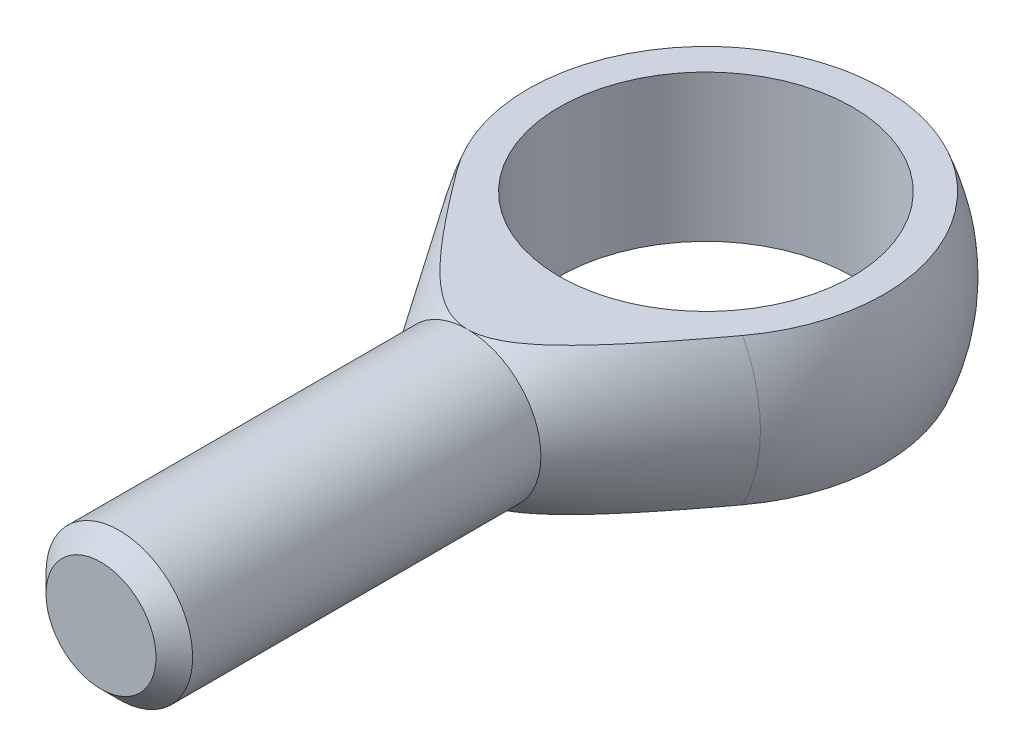
ISO-10303-21;
HEADER;
FILE_DESCRIPTION(('STEP AP214'),'2;1');
FILE_NAME('part.step','',(''),(''),'','','');
FILE_SCHEMA(('AUTOMOTIVE_DESIGN { 1 0 10303 214 1 1 1 1 }'));
ENDSEC;
DATA;
#1=APPLICATION_CONTEXT('core data for automotive mechanical design processes');
#2=APPLICATION_PROTOCOL_DEFINITION('international standard','automotive_design',2000,#1);
#3=PRODUCT_CONTEXT('',#1,'mechanical');
#4=PRODUCT('Part','Part','',(#3));
#5=PRODUCT_RELATED_PRODUCT_CATEGORY('part','',(#4));
#6=PRODUCT_DEFINITION_FORMATION('','',#4);
#7=PRODUCT_DEFINITION_CONTEXT('part definition',#1,'design');
#8=PRODUCT_DEFINITION('design','',#6,#7);
#9=PRODUCT_DEFINITION_SHAPE('','',#8);
#10=(LENGTH_UNIT() NAMED_UNIT(*) SI_UNIT(.MILLI.,.METRE.));
#11=(NAMED_UNIT(*) PLANE_ANGLE_UNIT() SI_UNIT($,.RADIAN.));
#12=(NAMED_UNIT(*) SI_UNIT($,.STERADIAN.) SOLID_ANGLE_UNIT());
#13=UNCERTAINTY_MEASURE_WITH_UNIT(LENGTH_MEASURE(1.E-05),#10,'distance_accuracy_value','');
#14=(GEOMETRIC_REPRESENTATION_CONTEXT(3) GLOBAL_UNCERTAINTY_ASSIGNED_CONTEXT((#13)) GLOBAL_UNIT_ASSIGNED_CONTEXT((#10,
#11,#12)) REPRESENTATION_CONTEXT('',''));
#15=CARTESIAN_POINT('',(0.,0.,0.));
#16=DIRECTION('',(0.,0.,1.));
#17=DIRECTION('',(1.,0.,0.));
#18=AXIS2_PLACEMENT_3D('',#15,#16,#17);
#19=CARTESIAN_POINT('',(0.,0.,26.));
#20=DIRECTION('',(0.,0.,-1.));
#21=DIRECTION('',(-1.,0.,0.));
#22=AXIS2_PLACEMENT_3D('',#19,#20,#21);
#23=CONICAL_SURFACE('',#22,8.,0.583443982313992);
#24=CARTESIAN_POINT('',(0.,0.,11.5689303158746));
#25=DIRECTION('',(0.,0.,-1.));
#26=DIRECTION('',(-1.,0.,0.));
#27=AXIS2_PLACEMENT_3D('',#24,#25,#26);
#28=CIRCLE('',#27,17.5259764734076);
#29=CARTESIAN_POINT('',(-15.5935836595197,-8.,11.5689303158746));
#30=VERTEX_POINT('',#29);
#31=CARTESIAN_POINT('',(-15.5935836595197,8.,11.5689303158746));
#32=VERTEX_POINT('',#31);
#33=EDGE_CURVE('E97',#30,#32,#28,.T.);
#34=ORIENTED_EDGE('',*,*,#33,.F.);
#35=CARTESIAN_POINT('',(-41.7893397113062,-8.,-26.337669903796));
#36=CARTESIAN_POINT('',(-41.1557149048194,-8.,-25.394905966181));
#37=CARTESIAN_POINT('',(-40.5217446952214,-8.,-24.4523741212144));
#38=CARTESIAN_POINT('',(-39.2529967304389,-8.,-22.5678533742964));
#39=CARTESIAN_POINT('',(-38.618218974807,-8.,-21.6258644726461));
#40=CARTESIAN_POINT('',(-36.71236789742,-8.,-18.8006355634881));
#41=CARTESIAN_POINT('',(-35.4399088161728,-8.,-16.9183299344262));
#42=CARTESIAN_POINT('',(-32.8858967777199,-8.,-13.1510921420859));
#43=CARTESIAN_POINT('',(-31.6043277485039,-8.,-11.2661708644965));
#44=CARTESIAN_POINT('',(-29.6766484690636,-8.,-8.44255526329719));
#45=CARTESIAN_POINT('',(-29.033231689383,-8.,-7.50202224300151));
#46=CARTESIAN_POINT('',(-27.7442089664126,-8.,-5.62245895299214));
#47=CARTESIAN_POINT('',(-27.0986030262145,-8.,-4.68342868115889));
#48=CARTESIAN_POINT('',(-25.7984650944112,-8.,-2.7981615987806));
#49=CARTESIAN_POINT('',(-25.1439070952088,-8.,-1.85194271580022));
#50=CARTESIAN_POINT('',(-23.8313788922483,-8.,0.0381249766633964));
#51=CARTESIAN_POINT('',(-23.1734086929347,-8.,0.981973789231412));
#52=CARTESIAN_POINT('',(-21.8529337576566,-8.,2.86691961563203));
#53=CARTESIAN_POINT('',(-21.1904277190853,-8.,3.80801571780575));
#54=CARTESIAN_POINT('',(-19.8597915373833,-8.,5.68619961889504));
#55=CARTESIAN_POINT('',(-19.1916615021039,-8.,6.62328749415891));
#56=CARTESIAN_POINT('',(-17.8490377414385,-8.,8.49051631845942));
#57=CARTESIAN_POINT('',(-17.1745566185374,-8.,9.42066630484811));
#58=CARTESIAN_POINT('',(-16.1550745456963,-8.,10.8102608695757));
#59=CARTESIAN_POINT('',(-15.8139386012655,-8.,11.2725408824194));
#60=CARTESIAN_POINT('',(-15.1285799337566,-8.,12.1948069144964));
#61=CARTESIAN_POINT('',(-14.7843572214204,-8.,12.6547929417041));
#62=CARTESIAN_POINT('',(-14.0923747580127,-8.,13.5717418107129));
#63=CARTESIAN_POINT('',(-13.7446168443339,-8.,14.0287060377496));
#64=CARTESIAN_POINT('',(-13.0445907078003,-8.,14.9391654201993));
#65=CARTESIAN_POINT('',(-12.6923225285202,-8.,15.3926606090601));
#66=CARTESIAN_POINT('',(-11.9822609691241,-8.,16.2952051774635));
#67=CARTESIAN_POINT('',(-11.6244683870814,-8.,16.7442551840711));
#68=CARTESIAN_POINT('',(-10.9019009711095,-8.,17.6366931011255));
#69=CARTESIAN_POINT('',(-10.5371264612838,-8.,18.0800812728114));
#70=CARTESIAN_POINT('',(-10.0453269965719,-8.,18.6655983345714));
#71=CARTESIAN_POINT('',(-9.92228865482356,-8.,18.8110804538051));
#72=CARTESIAN_POINT('',(-9.67512545946615,-8.,19.1011245077806));
#73=CARTESIAN_POINT('',(-9.55100058449968,-8.,19.2456864243375));
#74=CARTESIAN_POINT('',(-9.30156002344154,-8.,19.5337955344612));
#75=CARTESIAN_POINT('',(-9.17624426489803,-8.,19.677342665351));
#76=CARTESIAN_POINT('',(-8.92431499672733,-8.,19.9632920604024));
#77=CARTESIAN_POINT('',(-8.79770149101735,-8.,20.1056943280174));
#78=CARTESIAN_POINT('',(-8.41504916012535,-8.,20.5317407790535));
#79=CARTESIAN_POINT('',(-8.15685724743617,-8.,20.8134608639338));
#80=CARTESIAN_POINT('',(-7.63352118646919,-8.,21.3703563931461));
#81=CARTESIAN_POINT('',(-7.36837750568537,-8.,21.6455322752029));
#82=CARTESIAN_POINT('',(-6.82265047469856,-8.,22.194262460371));
#83=CARTESIAN_POINT('',(-6.54184597688306,-8.,22.4675977243717));
#84=CARTESIAN_POINT('',(-5.96877991117981,-8.,23.0023740909599));
#85=CARTESIAN_POINT('',(-5.6765136245208,-8.,23.2638101969509));
#86=CARTESIAN_POINT('',(-5.22779910687375,-8.,23.6429870211736));
#87=CARTESIAN_POINT('',(-5.07670513469256,-8.,23.7670682966121));
#88=CARTESIAN_POINT('',(-4.77052383447761,-8.,24.0101890400232));
#89=CARTESIAN_POINT('',(-4.61543695116889,-8.,24.1292290656108));
#90=CARTESIAN_POINT('',(-4.30091121552167,-8.,24.3611709536904));
#91=CARTESIAN_POINT('',(-4.14147589954388,-8.,24.4740775929998));
#92=CARTESIAN_POINT('',(-3.81767218441554,-8.,24.6925543289047));
#93=CARTESIAN_POINT('',(-3.65330476387961,-8.,24.7981258673071));
#94=CARTESIAN_POINT('',(-3.33134243037947,-8.,24.9929764293246));
#95=CARTESIAN_POINT('',(-3.17412865893547,-8.,25.0828821963727));
#96=CARTESIAN_POINT('',(-2.85474077312491,-8.,25.253487389059));
#97=CARTESIAN_POINT('',(-2.69256651220986,-8.,25.3341865423711));
#98=CARTESIAN_POINT('',(-2.36335395977583,-8.,25.4844516330758));
#99=CARTESIAN_POINT('',(-2.19632224838547,-8.,25.5540318717474));
#100=CARTESIAN_POINT('',(-1.85740960386001,-8.,25.680121662853));
#101=CARTESIAN_POINT('',(-1.68553055556196,-8.,25.7366362192176));
#102=CARTESIAN_POINT('',(-1.36237703270374,-8.,25.8275233153272));
#103=CARTESIAN_POINT('',(-1.21167023381903,-8.,25.8639063663816));
#104=CARTESIAN_POINT('',(-0.9077943549243,-8.,25.9243557327484));
#105=CARTESIAN_POINT('',(-0.754625537518869,-8.,25.948423352779));
#106=CARTESIAN_POINT('',(-0.446871147442258,-8.,25.9833312715307));
#107=CARTESIAN_POINT('',(-0.2922865340359,-8.,25.9941799423972));
#108=CARTESIAN_POINT('',(0.017243593059444,-8.,26.0022390275379));
#109=CARTESIAN_POINT('',(0.172189110252937,-8.,25.9994493088218));
#110=CARTESIAN_POINT('',(0.481119496647998,-8.,25.9803533180131));
#111=CARTESIAN_POINT('',(0.635104996521218,-8.,25.9640571356025));
#112=CARTESIAN_POINT('',(0.941147894900533,-8.,25.9186042646396));
#113=CARTESIAN_POINT('',(1.09320525868139,-8.,25.8894473448063));
#114=CARTESIAN_POINT('',(1.39462211112206,-8.,25.8192945419706));
#115=CARTESIAN_POINT('',(1.54398017684953,-8.,25.778292597782));
#116=CARTESIAN_POINT('',(1.83936434374538,-8.,25.6857181652654));
#117=CARTESIAN_POINT('',(1.98539004514737,-8.,25.6341444160245));
#118=CARTESIAN_POINT('',(2.37334785538949,-8.,25.482957652231));
#119=CARTESIAN_POINT('',(2.61194225836789,-8.,25.3747496800453));
#120=CARTESIAN_POINT('',(3.07871304264103,-8.,25.1378138107562));
#121=CARTESIAN_POINT('',(3.30688082819653,-8.,25.0090693623793));
#122=CARTESIAN_POINT('',(3.75460909156237,-8.,24.7352391664537));
#123=CARTESIAN_POINT('',(3.97412329515662,-8.,24.590078363952));
#124=CARTESIAN_POINT('',(4.29685928466906,-8.,24.3632590449313));
#125=CARTESIAN_POINT('',(4.40333297776572,-8.,24.2861520457739));
#126=CARTESIAN_POINT('',(4.61428006071462,-8.,24.1292481111753));
#127=CARTESIAN_POINT('',(4.71875347899604,-8.,24.0494512140091));
#128=CARTESIAN_POINT('',(5.01599602551024,-8.,23.8169891709865));
#129=CARTESIAN_POINT('',(5.20645303336845,-8.,23.661364649537));
#130=CARTESIAN_POINT('',(5.58177782763677,-8.,23.3434920456619));
#131=CARTESIAN_POINT('',(5.76664460877452,-8.,23.1812427841153));
#132=CARTESIAN_POINT('',(6.13163792982774,-8.,22.8512912982533));
#133=CARTESIAN_POINT('',(6.31176150305143,-8.,22.6835858012784));
#134=CARTESIAN_POINT('',(6.6678153780134,-8.,22.3437701591296));
#135=CARTESIAN_POINT('',(6.84374539269315,-8.,22.1716597140898));
#136=CARTESIAN_POINT('',(7.19239026527735,-8.,21.823357240046));
#137=CARTESIAN_POINT('',(7.36509598402218,-8.,21.6471560814312));
#138=CARTESIAN_POINT('',(7.70730993896773,-8.,21.2916715681948));
#139=CARTESIAN_POINT('',(7.87681806983155,-8.,21.1123881124048));
#140=CARTESIAN_POINT('',(8.38103102730631,-8.,20.570779100684));
#141=CARTESIAN_POINT('',(8.71155686515788,-8.,20.2045611594055));
#142=CARTESIAN_POINT('',(9.36696230830657,-8.,19.4610833670985));
#143=CARTESIAN_POINT('',(9.69176086119772,-8.,19.083752516552));
#144=CARTESIAN_POINT('',(10.3343867706041,-8.,18.3231671296867));
#145=CARTESIAN_POINT('',(10.6522136230684,-8.,17.9399121684498));
#146=CARTESIAN_POINT('',(11.2817141552758,-8.,17.1694624759606));
#147=CARTESIAN_POINT('',(11.5933972568266,-8.,16.7822754262249));
#148=CARTESIAN_POINT('',(12.0574777532771,-8.,16.1987731967306));
#149=CARTESIAN_POINT('',(12.2115949032139,-8.,16.0038218367269));
#150=CARTESIAN_POINT('',(12.5187851806359,-8.,15.6130984378208));
#151=CARTESIAN_POINT('',(12.6718583089522,-8.,15.4173263995719));
#152=CARTESIAN_POINT('',(13.1608086446923,-8.,14.7888649640009));
#153=CARTESIAN_POINT('',(13.4948591455196,-8.,14.3547536082084));
#154=CARTESIAN_POINT('',(14.1591833346824,-8.,13.4836481710026));
#155=CARTESIAN_POINT('',(14.4894569800663,-8.,13.0466540568947));
#156=CARTESIAN_POINT('',(15.1468695054673,-8.,12.1702894039626));
#157=CARTESIAN_POINT('',(15.4740082642428,-8.,11.7309187742466));
#158=CARTESIAN_POINT('',(16.1256342829024,-8.,10.8502147177181));
#159=CARTESIAN_POINT('',(16.4501215318242,-8.,10.4088812828022));
#160=CARTESIAN_POINT('',(17.4203159238502,-8.,9.08229630095648));
#161=CARTESIAN_POINT('',(18.0626615174788,-8.,8.19458617130412));
#162=CARTESIAN_POINT('',(19.3407385593065,-8.,6.41441777093976));
#163=CARTESIAN_POINT('',(19.9764699547765,-8.,5.52195946246024));
#164=CARTESIAN_POINT('',(21.2436892097622,-8.,3.73232190124357));
#165=CARTESIAN_POINT('',(21.8751705950962,-8.,2.83513806753905));
#166=CARTESIAN_POINT('',(23.1341862593397,-8.,1.03800127547844));
#167=CARTESIAN_POINT('',(23.7617205196844,-8.,0.138048304127656));
#168=CARTESIAN_POINT('',(25.0135896024525,-8.,-1.66395391791588));
#169=CARTESIAN_POINT('',(25.6379247194812,-8.,-2.56600296404517));
#170=CARTESIAN_POINT('',(26.884052891512,-8.,-4.37185503861865));
#171=CARTESIAN_POINT('',(27.505845945233,-8.,-5.27565806794637));
#172=CARTESIAN_POINT('',(29.2759214171934,-8.,-7.85485794708336));
#173=CARTESIAN_POINT('',(30.4216893880862,-8.,-9.53198026409849));
#174=CARTESIAN_POINT('',(32.7082005475804,-8.,-12.8897134135342));
#175=CARTESIAN_POINT('',(33.8489435911886,-8.,-14.5703243445859));
#176=CARTESIAN_POINT('',(36.1245857153204,-8.,-17.9310043169582));
#177=CARTESIAN_POINT('',(37.2594916763625,-8.,-19.6110687004831));
#178=CARTESIAN_POINT('',(38.9596924002792,-8.,-22.1325794836291));
#179=CARTESIAN_POINT('',(39.5260569796141,-8.,-22.9733049475566));
#180=CARTESIAN_POINT('',(40.6581530556589,-8.,-24.6551816601679));
#181=CARTESIAN_POINT('',(41.223884552559,-8.,-25.4963329087237));
#182=CARTESIAN_POINT('',(41.7893397113062,-8.,-26.3376699037959));
#183=B_SPLINE_CURVE_WITH_KNOTS('',3,(#35,#36,#37,#38,#39,#40,#41,#42,#43,#44,#45,#46,#47,#48,
#49,#50,#51,#52,#53,#54,#55,#56,#57,#58,#59,#60,#61,#62,#63,#64,#65,#66,#67,#68,#69,#70,#71,#72,
#73,#74,#75,#76,#77,#78,#79,#80,#81,#82,#83,#84,#85,#86,#87,#88,#89,#90,#91,#92,#93,#94,#95,#96,
#97,#98,#99,#100,#101,#102,#103,#104,#105,#106,#107,#108,#109,#110,#111,#112,#113,#114,#115,
#116,#117,#118,#119,#120,#121,#122,#123,#124,#125,#126,#127,#128,#129,#130,#131,#132,#133,#134,
#135,#136,#137,#138,#139,#140,#141,#142,#143,#144,#145,#146,#147,#148,#149,#150,#151,#152,#153,
#154,#155,#156,#157,#158,#159,#160,#161,#162,#163,#164,#165,#166,#167,#168,#169,#170,#171,#172,
#173,#174,#175,#176,#177,#178,#179,#180,#181,#182),.UNSPECIFIED.,.F.,.F.,(4,2,2,2,2,2,2,2,2,2,2,
2,2,2,2,2,2,2,2,2,2,2,2,2,2,2,2,2,2,2,2,2,2,2,2,2,2,2,2,2,2,2,2,2,2,2,2,2,2,2,2,2,2,2,2,2,2,2,2,
2,2,2,2,2,2,2,2,2,2,2,2,2,2,4),(0.,3.40772031445457,6.81544251742736,13.6315973726992,
20.469575344042,23.8882404822343,27.3069007942674,30.7585592613717,34.2102132336201,
37.6629039219994,41.1155285483487,44.5623424381296,46.2859011427508,48.0094538517592,
49.7321524175262,51.4548343524362,53.1772697092747,54.8996253030469,55.4712253702205,
56.042836698383,56.6144830281691,57.1861276329635,58.3324420856408,59.4786796474449,
60.6540550389304,61.8299195148678,62.4163767003356,63.002768847175,63.5886975509105,
64.1745107551842,64.7175725017291,65.2606503075559,65.8030238781542,66.345189383677,
66.8098370899034,67.2744355603417,67.7387396268031,68.2030482207791,68.6670102763717,
69.1309806759682,69.5951889144585,70.0594525519157,70.844015410507,71.6292138085734,
72.4181594872099,72.8125119792112,73.2068588622576,73.944512882573,74.6822987733587,
75.4205356577836,76.1588229319035,76.8989562316257,77.6391138708417,79.1188647471267,
80.6123716930422,82.105986265329,83.5970969940853,84.3426296310782,85.0881616745519,
86.7314168572388,88.3746907089671,90.0180278598085,91.6613718014572,94.9485318377912,
98.2357180597637,101.527112369136,104.8185221476,108.10962317107,111.400725852797,
117.494126364826,123.587701563831,129.670102454631,132.711202920313,135.75230247217),.UNSPECIFIED.);
#184=CARTESIAN_POINT('',(0.,-8.00000000000001,26.));
#185=VERTEX_POINT('',#184);
#186=EDGE_CURVE('E93',#30,#185,#183,.T.);
#187=ORIENTED_EDGE('',*,*,#186,.T.);
#188=CARTESIAN_POINT('',(0.,0.,26.));
#189=DIRECTION('',(0.,0.,-1.));
#190=DIRECTION('',(-1.,0.,0.));
#191=AXIS2_PLACEMENT_3D('',#188,#189,#190);
#192=CIRCLE('',#191,8.);
#193=CARTESIAN_POINT('',(0.,8.00000000000001,26.));
#194=VERTEX_POINT('',#193);
#195=EDGE_CURVE('E92',#185,#194,#192,.T.);
#196=ORIENTED_EDGE('',*,*,#195,.T.);
#197=CARTESIAN_POINT('',(41.7893397113062,8.,-26.3376699037959));
#198=CARTESIAN_POINT('',(41.1557149048194,8.,-25.394905966181));
#199=CARTESIAN_POINT('',(40.5217446952214,8.,-24.4523741212144));
#200=CARTESIAN_POINT('',(39.2529967304389,8.,-22.5678533742964));
#201=CARTESIAN_POINT('',(38.618218974807,8.,-21.6258644726461));
#202=CARTESIAN_POINT('',(36.71236789742,8.,-18.8006355634881));
#203=CARTESIAN_POINT('',(35.4399088161728,8.,-16.9183299344262));
#204=CARTESIAN_POINT('',(32.88589677772,8.,-13.1510921420859));
#205=CARTESIAN_POINT('',(31.6043277485039,8.,-11.2661708644966));
#206=CARTESIAN_POINT('',(29.6766484690636,8.,-8.44255526329724));
#207=CARTESIAN_POINT('',(29.0332316893831,8.,-7.50202224300156));
#208=CARTESIAN_POINT('',(27.7442089664127,8.,-5.6224589529922));
#209=CARTESIAN_POINT('',(27.0986030262145,8.,-4.68342868115895));
#210=CARTESIAN_POINT('',(25.7984650944112,8.,-2.79816159878066));
#211=CARTESIAN_POINT('',(25.1439070952088,8.,-1.85194271580028));
#212=CARTESIAN_POINT('',(23.8313788922483,8.,0.0381249766633464));
#213=CARTESIAN_POINT('',(23.1734086929347,8.,0.981973789231365));
#214=CARTESIAN_POINT('',(21.8529337576566,8.,2.86691961563199));
#215=CARTESIAN_POINT('',(21.1904277190853,8.,3.80801571780572));
#216=CARTESIAN_POINT('',(19.8597915373833,8.,5.686199618895));
#217=CARTESIAN_POINT('',(19.1916615021039,8.,6.62328749415887));
#218=CARTESIAN_POINT('',(17.8490377414385,8.,8.49051631845939));
#219=CARTESIAN_POINT('',(17.1745566185374,8.,9.42066630484808));
#220=CARTESIAN_POINT('',(16.1550745456963,8.,10.8102608695756));
#221=CARTESIAN_POINT('',(15.8139386012655,8.,11.2725408824194));
#222=CARTESIAN_POINT('',(15.1285799337566,8.,12.1948069144964));
#223=CARTESIAN_POINT('',(14.7843572214204,8.,12.6547929417041));
#224=CARTESIAN_POINT('',(14.0923747580127,8.,13.5717418107129));
#225=CARTESIAN_POINT('',(13.7446168443339,8.,14.0287060377496));
#226=CARTESIAN_POINT('',(13.0445907078003,8.,14.9391654201993));
#227=CARTESIAN_POINT('',(12.6923225285202,8.,15.3926606090601));
#228=CARTESIAN_POINT('',(11.9822609691241,8.,16.2952051774635));
#229=CARTESIAN_POINT('',(11.6244683870814,8.,16.7442551840711));
#230=CARTESIAN_POINT('',(10.9019009711095,8.,17.6366931011255));
#231=CARTESIAN_POINT('',(10.5371264612838,8.,18.0800812728114));
#232=CARTESIAN_POINT('',(10.0453269965719,8.,18.6655983345714));
#233=CARTESIAN_POINT('',(9.92228865482356,8.,18.8110804538051));
#234=CARTESIAN_POINT('',(9.67512545946615,8.,19.1011245077806));
#235=CARTESIAN_POINT('',(9.55100058449968,8.,19.2456864243375));
#236=CARTESIAN_POINT('',(9.30156002344154,8.,19.5337955344612));
#237=CARTESIAN_POINT('',(9.17624426489803,8.,19.677342665351));
#238=CARTESIAN_POINT('',(8.92431499672733,8.,19.9632920604024));
#239=CARTESIAN_POINT('',(8.79770149101735,8.,20.1056943280174));
#240=CARTESIAN_POINT('',(8.41504916012535,8.,20.5317407790535));
#241=CARTESIAN_POINT('',(8.15685724743617,8.,20.8134608639338));
#242=CARTESIAN_POINT('',(7.63352118646919,8.,21.3703563931461));
#243=CARTESIAN_POINT('',(7.36837750568537,8.,21.6455322752029));
#244=CARTESIAN_POINT('',(6.82265047469856,8.,22.194262460371));
#245=CARTESIAN_POINT('',(6.54184597688306,8.,22.4675977243717));
#246=CARTESIAN_POINT('',(5.96877991117981,8.,23.0023740909599));
#247=CARTESIAN_POINT('',(5.6765136245208,8.,23.2638101969509));
#248=CARTESIAN_POINT('',(5.22779910687375,8.,23.6429870211736));
#249=CARTESIAN_POINT('',(5.07670513469256,8.,23.7670682966121));
#250=CARTESIAN_POINT('',(4.77052383447761,8.,24.0101890400232));
#251=CARTESIAN_POINT('',(4.61543695116889,8.,24.1292290656108));
#252=CARTESIAN_POINT('',(4.30091121552167,8.,24.3611709536904));
#253=CARTESIAN_POINT('',(4.14147589954387,8.,24.4740775929999));
#254=CARTESIAN_POINT('',(3.81767218441553,8.,24.6925543289047));
#255=CARTESIAN_POINT('',(3.65330476387961,8.,24.7981258673071));
#256=CARTESIAN_POINT('',(3.33134243037946,8.,24.9929764293246));
#257=CARTESIAN_POINT('',(3.17412865893546,8.,25.0828821963727));
#258=CARTESIAN_POINT('',(2.85474077312491,8.,25.253487389059));
#259=CARTESIAN_POINT('',(2.69256651220985,8.,25.3341865423711));
#260=CARTESIAN_POINT('',(2.36335395977583,8.,25.4844516330758));
#261=CARTESIAN_POINT('',(2.19632224838547,8.,25.5540318717474));
#262=CARTESIAN_POINT('',(1.85740960386001,8.,25.680121662853));
#263=CARTESIAN_POINT('',(1.68553055556195,8.,25.7366362192176));
#264=CARTESIAN_POINT('',(1.36237703270374,8.,25.8275233153272));
#265=CARTESIAN_POINT('',(1.21167023381903,8.,25.8639063663816));
#266=CARTESIAN_POINT('',(0.907794354924299,8.,25.9243557327484));
#267=CARTESIAN_POINT('',(0.754625537518868,8.,25.948423352779));
#268=CARTESIAN_POINT('',(0.446871147442256,8.,25.9833312715307));
#269=CARTESIAN_POINT('',(0.292286534035899,8.,25.9941799423972));
#270=CARTESIAN_POINT('',(-0.0172435930594455,8.,26.0022390275379));
#271=CARTESIAN_POINT('',(-0.172189110252938,8.,25.9994493088218));
#272=CARTESIAN_POINT('',(-0.481119496648,8.,25.9803533180131));
#273=CARTESIAN_POINT('',(-0.63510499652122,8.,25.9640571356025));
#274=CARTESIAN_POINT('',(-0.941147894900534,8.,25.9186042646396));
#275=CARTESIAN_POINT('',(-1.09320525868139,8.,25.8894473448063));
#276=CARTESIAN_POINT('',(-1.39462211112206,8.,25.8192945419706));
#277=CARTESIAN_POINT('',(-1.54398017684953,8.,25.778292597782));
#278=CARTESIAN_POINT('',(-1.83936434374538,8.,25.6857181652654));
#279=CARTESIAN_POINT('',(-1.98539004514737,8.,25.6341444160245));
#280=CARTESIAN_POINT('',(-2.37334785538949,8.,25.482957652231));
#281=CARTESIAN_POINT('',(-2.6119422583679,8.,25.3747496800453));
#282=CARTESIAN_POINT('',(-3.07871304264103,8.,25.1378138107562));
#283=CARTESIAN_POINT('',(-3.30688082819653,8.,25.0090693623793));
#284=CARTESIAN_POINT('',(-3.75460909156237,8.,24.7352391664537));
#285=CARTESIAN_POINT('',(-3.97412329515662,8.,24.590078363952));
#286=CARTESIAN_POINT('',(-4.29685928466906,8.,24.3632590449313));
#287=CARTESIAN_POINT('',(-4.40333297776573,8.,24.2861520457739));
#288=CARTESIAN_POINT('',(-4.61428006071463,8.,24.1292481111753));
#289=CARTESIAN_POINT('',(-4.71875347899605,8.,24.0494512140091));
#290=CARTESIAN_POINT('',(-5.01599602551024,8.,23.8169891709865));
#291=CARTESIAN_POINT('',(-5.20645303336846,8.,23.661364649537));
#292=CARTESIAN_POINT('',(-5.58177782763677,8.,23.3434920456619));
#293=CARTESIAN_POINT('',(-5.76664460877452,8.,23.1812427841153));
#294=CARTESIAN_POINT('',(-6.13163792982773,8.,22.8512912982533));
#295=CARTESIAN_POINT('',(-6.31176150305142,8.,22.6835858012784));
#296=CARTESIAN_POINT('',(-6.6678153780134,8.,22.3437701591296));
#297=CARTESIAN_POINT('',(-6.84374539269315,8.,22.1716597140898));
#298=CARTESIAN_POINT('',(-7.19239026527734,8.,21.823357240046));
#299=CARTESIAN_POINT('',(-7.36509598402218,8.,21.6471560814312));
#300=CARTESIAN_POINT('',(-7.70730993896774,8.,21.2916715681947));
#301=CARTESIAN_POINT('',(-7.87681806983155,8.,21.1123881124048));
#302=CARTESIAN_POINT('',(-8.38103102730632,8.,20.5707791006839));
#303=CARTESIAN_POINT('',(-8.71155686515789,8.,20.2045611594055));
#304=CARTESIAN_POINT('',(-9.36696230830658,8.,19.4610833670985));
#305=CARTESIAN_POINT('',(-9.69176086119773,8.,19.0837525165519));
#306=CARTESIAN_POINT('',(-10.3343867706041,8.,18.3231671296867));
#307=CARTESIAN_POINT('',(-10.6522136230684,8.,17.9399121684498));
#308=CARTESIAN_POINT('',(-11.2817141552758,8.,17.1694624759606));
#309=CARTESIAN_POINT('',(-11.5933972568266,8.,16.7822754262249));
#310=CARTESIAN_POINT('',(-12.0574777532771,8.,16.1987731967306));
#311=CARTESIAN_POINT('',(-12.2115949032139,8.,16.0038218367269));
#312=CARTESIAN_POINT('',(-12.5187851806359,8.,15.6130984378208));
#313=CARTESIAN_POINT('',(-12.6718583089523,8.,15.4173263995719));
#314=CARTESIAN_POINT('',(-13.1608086446924,8.,14.7888649640009));
#315=CARTESIAN_POINT('',(-13.4948591455197,8.,14.3547536082084));
#316=CARTESIAN_POINT('',(-14.1591833346824,8.,13.4836481710026));
#317=CARTESIAN_POINT('',(-14.4894569800663,8.,13.0466540568947));
#318=CARTESIAN_POINT('',(-15.1468695054673,8.,12.1702894039626));
#319=CARTESIAN_POINT('',(-15.4740082642428,8.,11.7309187742466));
#320=CARTESIAN_POINT('',(-16.1256342829024,8.,10.8502147177181));
#321=CARTESIAN_POINT('',(-16.4501215318242,8.,10.4088812828021));
#322=CARTESIAN_POINT('',(-17.4203159238503,8.,9.08229630095646));
#323=CARTESIAN_POINT('',(-18.0626615174788,8.,8.1945861713041));
#324=CARTESIAN_POINT('',(-19.3407385593065,8.,6.41441777093975));
#325=CARTESIAN_POINT('',(-19.9764699547765,8.,5.52195946246022));
#326=CARTESIAN_POINT('',(-21.2436892097622,8.,3.73232190124355));
#327=CARTESIAN_POINT('',(-21.8751705950962,8.,2.83513806753903));
#328=CARTESIAN_POINT('',(-23.1341862593397,8.,1.03800127547841));
#329=CARTESIAN_POINT('',(-23.7617205196844,8.,0.13804830412763));
#330=CARTESIAN_POINT('',(-25.0135896024525,8.,-1.66395391791591));
#331=CARTESIAN_POINT('',(-25.6379247194812,8.,-2.56600296404521));
#332=CARTESIAN_POINT('',(-26.884052891512,8.,-4.37185503861868));
#333=CARTESIAN_POINT('',(-27.5058459452331,8.,-5.2756580679464));
#334=CARTESIAN_POINT('',(-29.2759214171934,8.,-7.85485794708338));
#335=CARTESIAN_POINT('',(-30.4216893880862,8.,-9.5319802640985));
#336=CARTESIAN_POINT('',(-32.7082005475804,8.,-12.8897134135342));
#337=CARTESIAN_POINT('',(-33.8489435911886,8.,-14.5703243445859));
#338=CARTESIAN_POINT('',(-36.1245857153204,8.,-17.9310043169582));
#339=CARTESIAN_POINT('',(-37.2594916763625,8.,-19.6110687004831));
#340=CARTESIAN_POINT('',(-38.9596924002792,8.,-22.1325794836291));
#341=CARTESIAN_POINT('',(-39.5260569796141,8.,-22.9733049475566));
#342=CARTESIAN_POINT('',(-40.6581530556589,8.,-24.6551816601679));
#343=CARTESIAN_POINT('',(-41.223884552559,8.,-25.4963329087237));
#344=CARTESIAN_POINT('',(-41.7893397113062,8.,-26.3376699037959));
#345=B_SPLINE_CURVE_WITH_KNOTS('',3,(#197,#198,#199,#200,#201,#202,#203,#204,#205,#206,#207,
#208,#209,#210,#211,#212,#213,#214,#215,#216,#217,#218,#219,#220,#221,#222,#223,#224,#225,#226,
#227,#228,#229,#230,#231,#232,#233,#234,#235,#236,#237,#238,#239,#240,#241,#242,#243,#244,#245,
#246,#247,#248,#249,#250,#251,#252,#253,#254,#255,#256,#257,#258,#259,#260,#261,#262,#263,#264,
#265,#266,#267,#268,#269,#270,#271,#272,#273,#274,#275,#276,#277,#278,#279,#280,#281,#282,#283,
#284,#285,#286,#287,#288,#289,#290,#291,#292,#293,#294,#295,#296,#297,#298,#299,#300,#301,#302,
#303,#304,#305,#306,#307,#308,#309,#310,#311,#312,#313,#314,#315,#316,#317,#318,#319,#320,#321,
#322,#323,#324,#325,#326,#327,#328,#329,#330,#331,#332,#333,#334,#335,#336,#337,#338,#339,#340,
#341,#342,#343,#344),.UNSPECIFIED.,.F.,.F.,(4,2,2,2,2,2,2,2,2,2,2,2,2,2,2,2,2,2,2,2,2,2,2,2,2,2,
2,2,2,2,2,2,2,2,2,2,2,2,2,2,2,2,2,2,2,2,2,2,2,2,2,2,2,2,2,2,2,2,2,2,2,2,2,2,2,2,2,2,2,2,2,2,2,
4),(0.,3.40772031445456,6.81544251742734,13.6315973726992,20.4695753440419,23.8882404822342,
27.3069007942673,30.7585592613717,34.21021323362,37.6629039219994,41.1155285483487,
44.5623424381295,46.2859011427508,48.0094538517591,49.7321524175262,51.4548343524362,
53.1772697092746,54.8996253030469,55.4712253702205,56.042836698383,56.614483028169,
57.1861276329635,58.3324420856408,59.4786796474449,60.6540550389304,61.8299195148678,
62.4163767003356,63.0027688471749,63.5886975509105,64.1745107551842,64.7175725017291,
65.2606503075558,65.8030238781542,66.3451893836769,66.8098370899034,67.2744355603416,
67.7387396268031,68.2030482207791,68.6670102763717,69.1309806759682,69.5951889144585,
70.0594525519157,70.844015410507,71.6292138085734,72.4181594872099,72.8125119792112,
73.2068588622576,73.944512882573,74.6822987733587,75.4205356577836,76.1588229319035,
76.8989562316257,77.6391138708417,79.1188647471267,80.6123716930422,82.105986265329,
83.5970969940853,84.3426296310782,85.0881616745519,86.7314168572388,88.3746907089671,
90.0180278598085,91.6613718014572,94.9485318377912,98.2357180597637,101.527112369136,
104.8185221476,108.10962317107,111.400725852797,117.494126364826,123.587701563831,
129.670102454631,132.711202920313,135.75230247217),.UNSPECIFIED.);
#346=EDGE_CURVE('E72',#194,#32,#345,.T.);
#347=ORIENTED_EDGE('',*,*,#346,.T.);
#348=EDGE_LOOP('',(#34,#187,#196,#347));
#349=FACE_BOUND('',#348,.T.);
#350=ADVANCED_FACE('F37',(#349),#23,.T.);
#351=EDGE_CURVE('E87',#194,#185,#192,.T.);
#352=ORIENTED_EDGE('',*,*,#351,.T.);
#353=CARTESIAN_POINT('',(15.5935836595197,-8.,11.5689303158746));
#354=VERTEX_POINT('',#353);
#355=EDGE_CURVE('E89',#185,#354,#183,.T.);
#356=ORIENTED_EDGE('',*,*,#355,.T.);
#357=CARTESIAN_POINT('',(15.5935836595197,8.,11.5689303158746));
#358=VERTEX_POINT('',#357);
#359=EDGE_CURVE('E88',#358,#354,#28,.T.);
#360=ORIENTED_EDGE('',*,*,#359,.F.);
#361=EDGE_CURVE('E75',#358,#194,#345,.T.);
#362=ORIENTED_EDGE('',*,*,#361,.T.);
#363=EDGE_LOOP('',(#352,#356,#360,#362));
#364=FACE_BOUND('',#363,.T.);
#365=ADVANCED_FACE('F85',(#364),#23,.T.);
#366=CARTESIAN_POINT('',(0.,0.,0.));
#367=DIRECTION('',(0.,0.,-1.));
#368=DIRECTION('',(1.,0.,0.));
#369=AXIS2_PLACEMENT_3D('',#366,#367,#368);
#370=SPHERICAL_SURFACE('',#369,21.);
#371=CARTESIAN_POINT('',(0.,-8.,0.));
#372=DIRECTION('',(0.,1.,0.));
#373=DIRECTION('',(0.,0.,1.));
#374=AXIS2_PLACEMENT_3D('',#371,#372,#373);
#375=CIRCLE('',#374,19.4164878389476);
#376=EDGE_CURVE('E53',#354,#30,#375,.T.);
#377=ORIENTED_EDGE('',*,*,#376,.T.);
#378=ORIENTED_EDGE('',*,*,#33,.T.);
#379=CARTESIAN_POINT('',(0.,8.,0.));
#380=DIRECTION('',(0.,-1.,0.));
#381=DIRECTION('',(0.,0.,-1.));
#382=AXIS2_PLACEMENT_3D('',#379,#380,#381);
#383=CIRCLE('',#382,19.4164878389476);
#384=EDGE_CURVE('E77',#32,#358,#383,.T.);
#385=ORIENTED_EDGE('',*,*,#384,.T.);
#386=ORIENTED_EDGE('',*,*,#359,.T.);
#387=EDGE_LOOP('',(#377,#378,#385,#386));
#388=FACE_BOUND('',#387,.T.);
#389=ADVANCED_FACE('F125',(#388),#370,.T.);
#390=CARTESIAN_POINT('',(0.,0.,66.));
#391=DIRECTION('',(0.,0.,-1.));
#392=DIRECTION('',(-1.,0.,0.));
#393=AXIS2_PLACEMENT_3D('',#390,#391,#392);
#394=PLANE('',#393);
#395=CARTESIAN_POINT('',(0.,0.,66.));
#396=DIRECTION('',(0.,0.,-1.));
#397=DIRECTION('',(-1.,0.,0.));
#398=AXIS2_PLACEMENT_3D('',#395,#396,#397);
#399=CIRCLE('',#398,5.99999999999998);
#400=CARTESIAN_POINT('',(-5.99999999999998,0.,66.));
#401=VERTEX_POINT('',#400);
#402=EDGE_CURVE('E11',#401,#401,#399,.F.);
#403=ORIENTED_EDGE('',*,*,#402,.T.);
#404=EDGE_LOOP('',(#403));
#405=FACE_BOUND('',#404,.T.);
#406=ADVANCED_FACE('F143',(#405),#394,.F.);
#407=CARTESIAN_POINT('',(0.,0.,-26.0435164980697));
#408=DIRECTION('',(0.,0.,-1.));
#409=DIRECTION('',(-1.,0.,0.));
#410=AXIS2_PLACEMENT_3D('',#407,#408,#409);
#411=CYLINDRICAL_SURFACE('',#410,8.00000000000001);
#412=CARTESIAN_POINT('',(0.,0.,64.));
#413=DIRECTION('',(0.,0.,-1.));
#414=DIRECTION('',(-1.,0.,0.));
#415=AXIS2_PLACEMENT_3D('',#412,#413,#414);
#416=CIRCLE('',#415,8.00000000000001);
#417=CARTESIAN_POINT('',(-8.00000000000001,0.,64.));
#418=VERTEX_POINT('',#417);
#419=EDGE_CURVE('E46',#418,#418,#416,.T.);
#420=ORIENTED_EDGE('',*,*,#419,.T.);
#421=EDGE_LOOP('',(#420));
#422=FACE_BOUND('',#421,.T.);
#423=ORIENTED_EDGE('',*,*,#351,.F.);
#424=ORIENTED_EDGE('',*,*,#195,.F.);
#425=EDGE_LOOP('',(#423,#424));
#426=FACE_BOUND('',#425,.T.);
#427=ADVANCED_FACE('F96',(#422,#426),#411,.T.);
#428=CARTESIAN_POINT('',(-21.,8.,26.));
#429=DIRECTION('',(0.,-1.,0.));
#430=DIRECTION('',(0.,0.,-1.));
#431=AXIS2_PLACEMENT_3D('',#428,#429,#430);
#432=PLANE('',#431);
#433=CARTESIAN_POINT('',(0.,8.00000000000001,0.));
#434=DIRECTION('',(0.,1.,0.));
#435=DIRECTION('',(0.,0.,1.));
#436=AXIS2_PLACEMENT_3D('',#433,#434,#435);
#437=CIRCLE('',#436,16.);
#438=CARTESIAN_POINT('',(0.,8.00000000000001,16.));
#439=VERTEX_POINT('',#438);
#440=EDGE_CURVE('E201',#439,#439,#437,.T.);
#441=ORIENTED_EDGE('',*,*,#440,.F.);
#442=EDGE_LOOP('',(#441));
#443=FACE_BOUND('',#442,.T.);
#444=ORIENTED_EDGE('',*,*,#361,.F.);
#445=ORIENTED_EDGE('',*,*,#384,.F.);
#446=ORIENTED_EDGE('',*,*,#346,.F.);
#447=EDGE_LOOP('',(#444,#445,#446));
#448=FACE_BOUND('',#447,.T.);
#449=ADVANCED_FACE('F74',(#443,#448),#432,.F.);
#450=CARTESIAN_POINT('',(-21.,-8.,26.));
#451=DIRECTION('',(0.,1.,0.));
#452=DIRECTION('',(0.,0.,1.));
#453=AXIS2_PLACEMENT_3D('',#450,#451,#452);
#454=PLANE('',#453);
#455=CARTESIAN_POINT('',(0.,-8.00000000000001,0.));
#456=DIRECTION('',(0.,1.,0.));
#457=DIRECTION('',(0.,0.,1.));
#458=AXIS2_PLACEMENT_3D('',#455,#456,#457);
#459=CIRCLE('',#458,16.);
#460=CARTESIAN_POINT('',(0.,-8.00000000000001,16.));
#461=VERTEX_POINT('',#460);
#462=EDGE_CURVE('E81',#461,#461,#459,.T.);
#463=ORIENTED_EDGE('',*,*,#462,.T.);
#464=EDGE_LOOP('',(#463));
#465=FACE_BOUND('',#464,.T.);
#466=ORIENTED_EDGE('',*,*,#186,.F.);
#467=ORIENTED_EDGE('',*,*,#376,.F.);
#468=ORIENTED_EDGE('',*,*,#355,.F.);
#469=EDGE_LOOP('',(#466,#467,#468));
#470=FACE_BOUND('',#469,.T.);
#471=ADVANCED_FACE('F117',(#465,#470),#454,.F.);
#472=CARTESIAN_POINT('',(0.,-8.00000000000001,0.));
#473=DIRECTION('',(0.,1.,0.));
#474=DIRECTION('',(0.,0.,1.));
#475=AXIS2_PLACEMENT_3D('',#472,#473,#474);
#476=CYLINDRICAL_SURFACE('',#475,16.);
#477=ORIENTED_EDGE('',*,*,#462,.F.);
#478=EDGE_LOOP('',(#477));
#479=FACE_BOUND('',#478,.T.);
#480=ORIENTED_EDGE('',*,*,#440,.T.);
#481=EDGE_LOOP('',(#480));
#482=FACE_BOUND('',#481,.T.);
#483=ADVANCED_FACE('F112',(#479,#482),#476,.F.);
#484=CARTESIAN_POINT('',(0.,0.,64.));
#485=DIRECTION('',(0.,0.,-1.));
#486=DIRECTION('',(-1.,0.,0.));
#487=AXIS2_PLACEMENT_3D('',#484,#485,#486);
#488=CONICAL_SURFACE('',#487,8.00000000000001,0.785398163397451);
#489=ORIENTED_EDGE('',*,*,#402,.F.);
#490=EDGE_LOOP('',(#489));
#491=FACE_BOUND('',#490,.T.);
#492=ORIENTED_EDGE('',*,*,#419,.F.);
#493=EDGE_LOOP('',(#492));
#494=FACE_BOUND('',#493,.T.);
#495=ADVANCED_FACE('F40',(#491,#494),#488,.T.);
#496=CLOSED_SHELL('',(#350,#365,#389,#406,#427,#449,#471,#483,#495));
#497=MANIFOLD_SOLID_BREP('B2',#496);
#498=ADVANCED_BREP_SHAPE_REPRESENTATION('',(#18,#497),#14);
#499=SHAPE_DEFINITION_REPRESENTATION(#9,#498);
ENDSEC;
END-ISO-10303-21;
